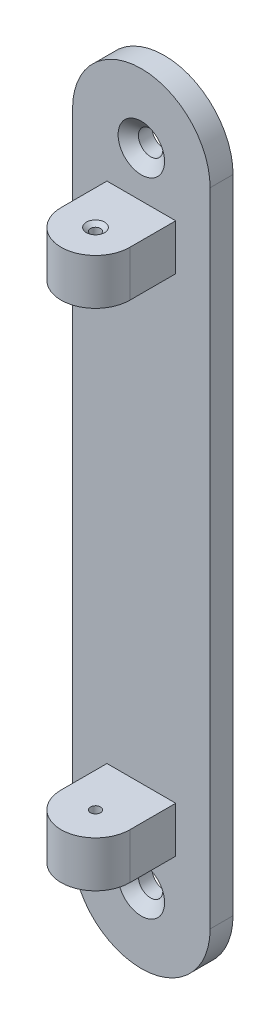
ISO-10303-21;
HEADER;
FILE_DESCRIPTION(('STEP AP214'),'2;1');
FILE_NAME('part.step','',(''),(''),'','','');
FILE_SCHEMA(('AUTOMOTIVE_DESIGN { 1 0 10303 214 1 1 1 1 }'));
ENDSEC;
DATA;
#1=APPLICATION_CONTEXT('core data for automotive mechanical design processes');
#2=APPLICATION_PROTOCOL_DEFINITION('international standard','automotive_design',2000,#1);
#3=PRODUCT_CONTEXT('',#1,'mechanical');
#4=PRODUCT('Part','Part','',(#3));
#5=PRODUCT_RELATED_PRODUCT_CATEGORY('part','',(#4));
#6=PRODUCT_DEFINITION_FORMATION('','',#4);
#7=PRODUCT_DEFINITION_CONTEXT('part definition',#1,'design');
#8=PRODUCT_DEFINITION('design','',#6,#7);
#9=PRODUCT_DEFINITION_SHAPE('','',#8);
#10=(LENGTH_UNIT() NAMED_UNIT(*) SI_UNIT(.MILLI.,.METRE.));
#11=(NAMED_UNIT(*) PLANE_ANGLE_UNIT() SI_UNIT($,.RADIAN.));
#12=(NAMED_UNIT(*) SI_UNIT($,.STERADIAN.) SOLID_ANGLE_UNIT());
#13=UNCERTAINTY_MEASURE_WITH_UNIT(LENGTH_MEASURE(1.E-05),#10,'distance_accuracy_value','');
#14=(GEOMETRIC_REPRESENTATION_CONTEXT(3) GLOBAL_UNCERTAINTY_ASSIGNED_CONTEXT((#13)) GLOBAL_UNIT_ASSIGNED_CONTEXT((#10,
#11,#12)) REPRESENTATION_CONTEXT('',''));
#15=CARTESIAN_POINT('',(0.,0.,0.));
#16=DIRECTION('',(0.,0.,1.));
#17=DIRECTION('',(1.,0.,0.));
#18=AXIS2_PLACEMENT_3D('',#15,#16,#17);
#19=CARTESIAN_POINT('',(19.05,88.9,6.35));
#20=DIRECTION('',(0.,0.,-1.));
#21=DIRECTION('',(-1.,0.,0.));
#22=AXIS2_PLACEMENT_3D('',#19,#20,#21);
#23=PLANE('',#22);
#24=DIRECTION('',(0.,-1.,0.));
#25=VECTOR('',#24,1.);
#26=CARTESIAN_POINT('',(0.,0.,6.35));
#27=LINE('',#26,#25);
#28=CARTESIAN_POINT('',(0.,88.9,6.35));
#29=VERTEX_POINT('',#28);
#30=CARTESIAN_POINT('',(0.,-88.9,6.35));
#31=VERTEX_POINT('',#30);
#32=EDGE_CURVE('E272',#29,#31,#27,.T.);
#33=ORIENTED_EDGE('',*,*,#32,.T.);
#34=CARTESIAN_POINT('',(19.05,-88.9,6.35));
#35=DIRECTION('',(0.,0.,-1.));
#36=DIRECTION('',(-1.,0.,0.));
#37=AXIS2_PLACEMENT_3D('',#34,#35,#36);
#38=CIRCLE('',#37,19.05);
#39=CARTESIAN_POINT('',(38.1,-88.9,6.35));
#40=VERTEX_POINT('',#39);
#41=EDGE_CURVE('E184',#40,#31,#38,.T.);
#42=ORIENTED_EDGE('',*,*,#41,.F.);
#43=DIRECTION('',(0.,1.,0.));
#44=VECTOR('',#43,1.);
#45=CARTESIAN_POINT('',(38.1,88.9,6.35));
#46=LINE('',#45,#44);
#47=CARTESIAN_POINT('',(38.1,88.9,6.35));
#48=VERTEX_POINT('',#47);
#49=EDGE_CURVE('E265',#40,#48,#46,.T.);
#50=ORIENTED_EDGE('',*,*,#49,.T.);
#51=CARTESIAN_POINT('',(19.05,88.9,6.35));
#52=DIRECTION('',(0.,0.,1.));
#53=DIRECTION('',(-1.,0.,0.));
#54=AXIS2_PLACEMENT_3D('',#51,#52,#53);
#55=CIRCLE('',#54,19.05);
#56=EDGE_CURVE('E268',#48,#29,#55,.T.);
#57=ORIENTED_EDGE('',*,*,#56,.T.);
#58=EDGE_LOOP('',(#33,#42,#50,#57));
#59=FACE_BOUND('',#58,.T.);
#60=CARTESIAN_POINT('',(19.05,88.9,6.35));
#61=DIRECTION('',(0.,0.,1.));
#62=DIRECTION('',(1.,0.,0.));
#63=AXIS2_PLACEMENT_3D('',#60,#61,#62);
#64=CIRCLE('',#63,6.4389);
#65=CARTESIAN_POINT('',(25.4889,88.9,6.35));
#66=VERTEX_POINT('',#65);
#67=EDGE_CURVE('E252',#66,#66,#64,.T.);
#68=ORIENTED_EDGE('',*,*,#67,.F.);
#69=EDGE_LOOP('',(#68));
#70=FACE_BOUND('',#69,.T.);
#71=DIRECTION('',(1.,0.,0.));
#72=VECTOR('',#71,1.);
#73=CARTESIAN_POINT('',(9.52500000000001,63.5071007439494,6.35));
#74=LINE('',#73,#72);
#75=CARTESIAN_POINT('',(9.52500000000001,63.5071007439494,6.35));
#76=VERTEX_POINT('',#75);
#77=CARTESIAN_POINT('',(28.575,63.5071007439494,6.35));
#78=VERTEX_POINT('',#77);
#79=EDGE_CURVE('E215',#76,#78,#74,.T.);
#80=ORIENTED_EDGE('',*,*,#79,.F.);
#81=DIRECTION('',(0.,-1.,0.));
#82=VECTOR('',#81,1.);
#83=CARTESIAN_POINT('',(9.525,76.2071007439494,6.35));
#84=LINE('',#83,#82);
#85=CARTESIAN_POINT('',(9.525,76.2071007439494,6.35));
#86=VERTEX_POINT('',#85);
#87=EDGE_CURVE('E224',#86,#76,#84,.T.);
#88=ORIENTED_EDGE('',*,*,#87,.F.);
#89=DIRECTION('',(1.,0.,0.));
#90=VECTOR('',#89,1.);
#91=CARTESIAN_POINT('',(9.525,76.2071007439494,6.35));
#92=LINE('',#91,#90);
#93=CARTESIAN_POINT('',(28.575,76.2071007439494,6.35));
#94=VERTEX_POINT('',#93);
#95=EDGE_CURVE('E64',#86,#94,#92,.T.);
#96=ORIENTED_EDGE('',*,*,#95,.T.);
#97=DIRECTION('',(0.,-1.,0.));
#98=VECTOR('',#97,1.);
#99=CARTESIAN_POINT('',(28.575,76.2071007439494,6.35));
#100=LINE('',#99,#98);
#101=EDGE_CURVE('E59',#94,#78,#100,.T.);
#102=ORIENTED_EDGE('',*,*,#101,.T.);
#103=EDGE_LOOP('',(#80,#88,#96,#102));
#104=FACE_BOUND('',#103,.T.);
#105=CARTESIAN_POINT('',(19.05,-88.9,6.35));
#106=DIRECTION('',(0.,0.,-1.));
#107=DIRECTION('',(1.,0.,0.));
#108=AXIS2_PLACEMENT_3D('',#105,#106,#107);
#109=CIRCLE('',#108,6.4389);
#110=CARTESIAN_POINT('',(25.4889,-88.9,6.35));
#111=VERTEX_POINT('',#110);
#112=EDGE_CURVE('E171',#111,#111,#109,.T.);
#113=ORIENTED_EDGE('',*,*,#112,.T.);
#114=EDGE_LOOP('',(#113));
#115=FACE_BOUND('',#114,.T.);
#116=DIRECTION('',(1.,0.,0.));
#117=VECTOR('',#116,1.);
#118=CARTESIAN_POINT('',(9.525,-63.5071007439494,6.35));
#119=LINE('',#118,#117);
#120=CARTESIAN_POINT('',(9.525,-63.5071007439494,6.35));
#121=VERTEX_POINT('',#120);
#122=CARTESIAN_POINT('',(28.575,-63.5071007439494,6.35));
#123=VERTEX_POINT('',#122);
#124=EDGE_CURVE('E151',#121,#123,#119,.T.);
#125=ORIENTED_EDGE('',*,*,#124,.T.);
#126=DIRECTION('',(0.,1.,0.));
#127=VECTOR('',#126,1.);
#128=CARTESIAN_POINT('',(28.575,-76.2071007439494,6.35));
#129=LINE('',#128,#127);
#130=CARTESIAN_POINT('',(28.575,-76.2071007439494,6.35));
#131=VERTEX_POINT('',#130);
#132=EDGE_CURVE('E345',#131,#123,#129,.T.);
#133=ORIENTED_EDGE('',*,*,#132,.F.);
#134=DIRECTION('',(1.,0.,0.));
#135=VECTOR('',#134,1.);
#136=CARTESIAN_POINT('',(9.525,-76.2071007439494,6.35));
#137=LINE('',#136,#135);
#138=CARTESIAN_POINT('',(9.525,-76.2071007439494,6.35));
#139=VERTEX_POINT('',#138);
#140=EDGE_CURVE('E349',#139,#131,#137,.T.);
#141=ORIENTED_EDGE('',*,*,#140,.F.);
#142=DIRECTION('',(0.,1.,0.));
#143=VECTOR('',#142,1.);
#144=CARTESIAN_POINT('',(9.525,-76.2071007439494,6.35));
#145=LINE('',#144,#143);
#146=EDGE_CURVE('E163',#139,#121,#145,.T.);
#147=ORIENTED_EDGE('',*,*,#146,.T.);
#148=EDGE_LOOP('',(#125,#133,#141,#147));
#149=FACE_BOUND('',#148,.T.);
#150=ADVANCED_FACE('F42',(#59,#70,#104,#115,#149),#23,.F.);
#151=CARTESIAN_POINT('',(38.1,88.9,6.35));
#152=DIRECTION('',(-1.,0.,0.));
#153=DIRECTION('',(0.,-1.,0.));
#154=AXIS2_PLACEMENT_3D('',#151,#152,#153);
#155=PLANE('',#154);
#156=DIRECTION('',(0.,1.,0.));
#157=VECTOR('',#156,1.);
#158=CARTESIAN_POINT('',(38.1,88.9,0.));
#159=LINE('',#158,#157);
#160=CARTESIAN_POINT('',(38.1,-88.9,0.));
#161=VERTEX_POINT('',#160);
#162=CARTESIAN_POINT('',(38.1,88.9,0.));
#163=VERTEX_POINT('',#162);
#164=EDGE_CURVE('E264',#161,#163,#159,.T.);
#165=ORIENTED_EDGE('',*,*,#164,.T.);
#166=DIRECTION('',(0.,0.,-1.));
#167=VECTOR('',#166,1.);
#168=CARTESIAN_POINT('',(38.1,88.9,6.35));
#169=LINE('',#168,#167);
#170=EDGE_CURVE('E11',#48,#163,#169,.T.);
#171=ORIENTED_EDGE('',*,*,#170,.F.);
#172=ORIENTED_EDGE('',*,*,#49,.F.);
#173=DIRECTION('',(0.,0.,-1.));
#174=VECTOR('',#173,1.);
#175=CARTESIAN_POINT('',(38.1,-88.9,6.35));
#176=LINE('',#175,#174);
#177=EDGE_CURVE('E195',#40,#161,#176,.T.);
#178=ORIENTED_EDGE('',*,*,#177,.T.);
#179=EDGE_LOOP('',(#165,#171,#172,#178));
#180=FACE_BOUND('',#179,.T.);
#181=ADVANCED_FACE('F44',(#180),#155,.F.);
#182=CARTESIAN_POINT('',(19.05,88.9,6.35));
#183=DIRECTION('',(0.,0.,-1.));
#184=DIRECTION('',(-1.,0.,0.));
#185=AXIS2_PLACEMENT_3D('',#182,#183,#184);
#186=CYLINDRICAL_SURFACE('',#185,19.05);
#187=CARTESIAN_POINT('',(19.05,88.9,0.));
#188=DIRECTION('',(0.,0.,1.));
#189=DIRECTION('',(-1.,0.,0.));
#190=AXIS2_PLACEMENT_3D('',#187,#188,#189);
#191=CIRCLE('',#190,19.05);
#192=CARTESIAN_POINT('',(0.,88.9,0.));
#193=VERTEX_POINT('',#192);
#194=EDGE_CURVE('E277',#163,#193,#191,.T.);
#195=ORIENTED_EDGE('',*,*,#194,.T.);
#196=DIRECTION('',(0.,0.,-1.));
#197=VECTOR('',#196,1.);
#198=CARTESIAN_POINT('',(0.,88.9,6.35));
#199=LINE('',#198,#197);
#200=EDGE_CURVE('E52',#29,#193,#199,.T.);
#201=ORIENTED_EDGE('',*,*,#200,.F.);
#202=ORIENTED_EDGE('',*,*,#56,.F.);
#203=ORIENTED_EDGE('',*,*,#170,.T.);
#204=EDGE_LOOP('',(#195,#201,#202,#203));
#205=FACE_BOUND('',#204,.T.);
#206=ADVANCED_FACE('F305',(#205),#186,.T.);
#207=CARTESIAN_POINT('',(0.,0.,6.35));
#208=DIRECTION('',(1.,0.,0.));
#209=DIRECTION('',(0.,0.,-1.));
#210=AXIS2_PLACEMENT_3D('',#207,#208,#209);
#211=PLANE('',#210);
#212=DIRECTION('',(0.,-1.,0.));
#213=VECTOR('',#212,1.);
#214=CARTESIAN_POINT('',(0.,0.,0.));
#215=LINE('',#214,#213);
#216=CARTESIAN_POINT('',(0.,-88.9,0.));
#217=VERTEX_POINT('',#216);
#218=EDGE_CURVE('E269',#193,#217,#215,.T.);
#219=ORIENTED_EDGE('',*,*,#218,.T.);
#220=DIRECTION('',(0.,0.,-1.));
#221=VECTOR('',#220,1.);
#222=CARTESIAN_POINT('',(0.,-88.9,6.35));
#223=LINE('',#222,#221);
#224=EDGE_CURVE('E188',#31,#217,#223,.T.);
#225=ORIENTED_EDGE('',*,*,#224,.F.);
#226=ORIENTED_EDGE('',*,*,#32,.F.);
#227=ORIENTED_EDGE('',*,*,#200,.T.);
#228=EDGE_LOOP('',(#219,#225,#226,#227));
#229=FACE_BOUND('',#228,.T.);
#230=ADVANCED_FACE('F288',(#229),#211,.F.);
#231=CARTESIAN_POINT('',(19.05,88.9,0.));
#232=DIRECTION('',(0.,0.,-1.));
#233=DIRECTION('',(-1.,0.,0.));
#234=AXIS2_PLACEMENT_3D('',#231,#232,#233);
#235=PLANE('',#234);
#236=CARTESIAN_POINT('',(19.05,88.9,0.));
#237=DIRECTION('',(0.,0.,1.));
#238=DIRECTION('',(1.,0.,0.));
#239=AXIS2_PLACEMENT_3D('',#236,#237,#238);
#240=CIRCLE('',#239,3.3782);
#241=CARTESIAN_POINT('',(22.4282,88.9,0.));
#242=VERTEX_POINT('',#241);
#243=EDGE_CURVE('E260',#242,#242,#240,.T.);
#244=ORIENTED_EDGE('',*,*,#243,.T.);
#245=EDGE_LOOP('',(#244));
#246=FACE_BOUND('',#245,.T.);
#247=ORIENTED_EDGE('',*,*,#164,.F.);
#248=CARTESIAN_POINT('',(19.05,-88.9,0.));
#249=DIRECTION('',(0.,0.,-1.));
#250=DIRECTION('',(-1.,0.,0.));
#251=AXIS2_PLACEMENT_3D('',#248,#249,#250);
#252=CIRCLE('',#251,19.05);
#253=EDGE_CURVE('E183',#161,#217,#252,.T.);
#254=ORIENTED_EDGE('',*,*,#253,.T.);
#255=ORIENTED_EDGE('',*,*,#218,.F.);
#256=ORIENTED_EDGE('',*,*,#194,.F.);
#257=EDGE_LOOP('',(#247,#254,#255,#256));
#258=FACE_BOUND('',#257,.T.);
#259=CARTESIAN_POINT('',(19.05,-88.9,0.));
#260=DIRECTION('',(0.,0.,-1.));
#261=DIRECTION('',(1.,0.,0.));
#262=AXIS2_PLACEMENT_3D('',#259,#260,#261);
#263=CIRCLE('',#262,3.3782);
#264=CARTESIAN_POINT('',(22.4282,-88.9,0.));
#265=VERTEX_POINT('',#264);
#266=EDGE_CURVE('E179',#265,#265,#263,.T.);
#267=ORIENTED_EDGE('',*,*,#266,.F.);
#268=EDGE_LOOP('',(#267));
#269=FACE_BOUND('',#268,.T.);
#270=ADVANCED_FACE('F294',(#246,#258,#269),#235,.T.);
#271=CARTESIAN_POINT('',(19.05,88.9,6.35));
#272=DIRECTION('',(0.,0.,1.));
#273=DIRECTION('',(1.,0.,0.));
#274=AXIS2_PLACEMENT_3D('',#271,#272,#273);
#275=CYLINDRICAL_SURFACE('',#274,3.37819999999999);
#276=ORIENTED_EDGE('',*,*,#243,.F.);
#277=EDGE_LOOP('',(#276));
#278=FACE_BOUND('',#277,.T.);
#279=CARTESIAN_POINT('',(19.05,88.9,3.78176775885568));
#280=DIRECTION('',(0.,0.,1.));
#281=DIRECTION('',(1.,0.,0.));
#282=AXIS2_PLACEMENT_3D('',#279,#280,#281);
#283=CIRCLE('',#282,3.37819999999999);
#284=CARTESIAN_POINT('',(22.4282,88.9,3.78176775885568));
#285=VERTEX_POINT('',#284);
#286=EDGE_CURVE('E256',#285,#285,#283,.T.);
#287=ORIENTED_EDGE('',*,*,#286,.T.);
#288=EDGE_LOOP('',(#287));
#289=FACE_BOUND('',#288,.T.);
#290=ADVANCED_FACE('F321',(#278,#289),#275,.F.);
#291=CARTESIAN_POINT('',(19.05,88.9,6.35));
#292=DIRECTION('',(0.,0.,1.));
#293=DIRECTION('',(1.,0.,0.));
#294=AXIS2_PLACEMENT_3D('',#291,#292,#293);
#295=CONICAL_SURFACE('',#294,6.4389,0.872664625997164);
#296=ORIENTED_EDGE('',*,*,#286,.F.);
#297=EDGE_LOOP('',(#296));
#298=FACE_BOUND('',#297,.T.);
#299=ORIENTED_EDGE('',*,*,#67,.T.);
#300=EDGE_LOOP('',(#299));
#301=FACE_BOUND('',#300,.T.);
#302=ADVANCED_FACE('F329',(#298,#301),#295,.F.);
#303=CARTESIAN_POINT('',(9.52500000000001,63.5071007439494,19.05));
#304=DIRECTION('',(0.,1.,0.));
#305=DIRECTION('',(0.,0.,1.));
#306=AXIS2_PLACEMENT_3D('',#303,#304,#305);
#307=PLANE('',#306);
#308=CARTESIAN_POINT('',(19.05,63.5071007439494,19.05));
#309=DIRECTION('',(0.,1.,0.));
#310=DIRECTION('',(0.,0.,1.));
#311=AXIS2_PLACEMENT_3D('',#308,#309,#310);
#312=CIRCLE('',#311,1.397);
#313=CARTESIAN_POINT('',(19.05,63.5071007439494,20.447));
#314=VERTEX_POINT('',#313);
#315=EDGE_CURVE('E46',#314,#314,#312,.T.);
#316=ORIENTED_EDGE('',*,*,#315,.T.);
#317=EDGE_LOOP('',(#316));
#318=FACE_BOUND('',#317,.T.);
#319=ORIENTED_EDGE('',*,*,#79,.T.);
#320=DIRECTION('',(0.,0.,-1.));
#321=VECTOR('',#320,1.);
#322=CARTESIAN_POINT('',(28.575,63.5071007439494,19.05));
#323=LINE('',#322,#321);
#324=CARTESIAN_POINT('',(28.575,63.5071007439494,19.05));
#325=VERTEX_POINT('',#324);
#326=EDGE_CURVE('E249',#325,#78,#323,.T.);
#327=ORIENTED_EDGE('',*,*,#326,.F.);
#328=CARTESIAN_POINT('',(19.05,63.5071007439494,19.05));
#329=DIRECTION('',(0.,-1.,0.));
#330=DIRECTION('',(0.,0.,-1.));
#331=AXIS2_PLACEMENT_3D('',#328,#329,#330);
#332=CIRCLE('',#331,9.525);
#333=CARTESIAN_POINT('',(9.525,63.5071007439494,19.05));
#334=VERTEX_POINT('',#333);
#335=EDGE_CURVE('E212',#325,#334,#332,.T.);
#336=ORIENTED_EDGE('',*,*,#335,.T.);
#337=DIRECTION('',(0.,0.,-1.));
#338=VECTOR('',#337,1.);
#339=CARTESIAN_POINT('',(9.52500000000001,63.5071007439494,19.05));
#340=LINE('',#339,#338);
#341=EDGE_CURVE('E228',#334,#76,#340,.T.);
#342=ORIENTED_EDGE('',*,*,#341,.T.);
#343=EDGE_LOOP('',(#319,#327,#336,#342));
#344=FACE_BOUND('',#343,.T.);
#345=ADVANCED_FACE('F337',(#318,#344),#307,.F.);
#346=CARTESIAN_POINT('',(28.575,76.2071007439494,19.05));
#347=DIRECTION('',(1.,0.,0.));
#348=DIRECTION('',(0.,0.,-1.));
#349=AXIS2_PLACEMENT_3D('',#346,#347,#348);
#350=PLANE('',#349);
#351=ORIENTED_EDGE('',*,*,#101,.F.);
#352=DIRECTION('',(0.,0.,-1.));
#353=VECTOR('',#352,1.);
#354=CARTESIAN_POINT('',(28.575,76.2071007439494,19.05));
#355=LINE('',#354,#353);
#356=CARTESIAN_POINT('',(28.575,76.2071007439494,19.05));
#357=VERTEX_POINT('',#356);
#358=EDGE_CURVE('E246',#357,#94,#355,.T.);
#359=ORIENTED_EDGE('',*,*,#358,.F.);
#360=DIRECTION('',(0.,-1.,0.));
#361=VECTOR('',#360,1.);
#362=CARTESIAN_POINT('',(28.575,76.2071007439494,19.05));
#363=LINE('',#362,#361);
#364=EDGE_CURVE('E219',#357,#325,#363,.T.);
#365=ORIENTED_EDGE('',*,*,#364,.T.);
#366=ORIENTED_EDGE('',*,*,#326,.T.);
#367=EDGE_LOOP('',(#351,#359,#365,#366));
#368=FACE_BOUND('',#367,.T.);
#369=ADVANCED_FACE('F423',(#368),#350,.T.);
#370=CARTESIAN_POINT('',(9.525,76.2071007439494,19.05));
#371=DIRECTION('',(0.,1.,0.));
#372=DIRECTION('',(0.,0.,1.));
#373=AXIS2_PLACEMENT_3D('',#370,#371,#372);
#374=PLANE('',#373);
#375=CARTESIAN_POINT('',(19.05,76.2071007439494,19.05));
#376=DIRECTION('',(0.,1.,0.));
#377=DIRECTION('',(0.,0.,1.));
#378=AXIS2_PLACEMENT_3D('',#375,#376,#377);
#379=CIRCLE('',#378,2.5273);
#380=CARTESIAN_POINT('',(19.05,76.2071007439494,21.5773));
#381=VERTEX_POINT('',#380);
#382=EDGE_CURVE('E199',#381,#381,#379,.T.);
#383=ORIENTED_EDGE('',*,*,#382,.F.);
#384=EDGE_LOOP('',(#383));
#385=FACE_BOUND('',#384,.T.);
#386=ORIENTED_EDGE('',*,*,#95,.F.);
#387=DIRECTION('',(0.,0.,-1.));
#388=VECTOR('',#387,1.);
#389=CARTESIAN_POINT('',(9.525,76.2071007439494,19.05));
#390=LINE('',#389,#388);
#391=CARTESIAN_POINT('',(9.525,76.2071007439494,19.05));
#392=VERTEX_POINT('',#391);
#393=EDGE_CURVE('E242',#392,#86,#390,.T.);
#394=ORIENTED_EDGE('',*,*,#393,.F.);
#395=CARTESIAN_POINT('',(19.05,76.2071007439494,19.05));
#396=DIRECTION('',(0.,-1.,0.));
#397=DIRECTION('',(0.,0.,-1.));
#398=AXIS2_PLACEMENT_3D('',#395,#396,#397);
#399=CIRCLE('',#398,9.525);
#400=EDGE_CURVE('E216',#357,#392,#399,.T.);
#401=ORIENTED_EDGE('',*,*,#400,.F.);
#402=ORIENTED_EDGE('',*,*,#358,.T.);
#403=EDGE_LOOP('',(#386,#394,#401,#402));
#404=FACE_BOUND('',#403,.T.);
#405=ADVANCED_FACE('F419',(#385,#404),#374,.T.);
#406=CARTESIAN_POINT('',(9.525,76.2071007439494,19.05));
#407=DIRECTION('',(1.,0.,0.));
#408=DIRECTION('',(0.,1.,0.));
#409=AXIS2_PLACEMENT_3D('',#406,#407,#408);
#410=PLANE('',#409);
#411=ORIENTED_EDGE('',*,*,#87,.T.);
#412=ORIENTED_EDGE('',*,*,#341,.F.);
#413=DIRECTION('',(0.,-1.,0.));
#414=VECTOR('',#413,1.);
#415=CARTESIAN_POINT('',(9.525,76.2071007439494,19.05));
#416=LINE('',#415,#414);
#417=EDGE_CURVE('E223',#392,#334,#416,.T.);
#418=ORIENTED_EDGE('',*,*,#417,.F.);
#419=ORIENTED_EDGE('',*,*,#393,.T.);
#420=EDGE_LOOP('',(#411,#412,#418,#419));
#421=FACE_BOUND('',#420,.T.);
#422=ADVANCED_FACE('F415',(#421),#410,.F.);
#423=CARTESIAN_POINT('',(19.05,63.5071007439494,19.05));
#424=DIRECTION('',(0.,1.,0.));
#425=DIRECTION('',(0.,0.,1.));
#426=AXIS2_PLACEMENT_3D('',#423,#424,#425);
#427=CYLINDRICAL_SURFACE('',#426,9.525);
#428=ORIENTED_EDGE('',*,*,#400,.T.);
#429=ORIENTED_EDGE('',*,*,#417,.T.);
#430=ORIENTED_EDGE('',*,*,#335,.F.);
#431=ORIENTED_EDGE('',*,*,#364,.F.);
#432=EDGE_LOOP('',(#428,#429,#430,#431));
#433=FACE_BOUND('',#432,.T.);
#434=ADVANCED_FACE('F411',(#433),#427,.T.);
#435=CARTESIAN_POINT('',(19.05,76.2071007439494,19.05));
#436=DIRECTION('',(0.,1.,0.));
#437=DIRECTION('',(0.,0.,1.));
#438=AXIS2_PLACEMENT_3D('',#435,#436,#437);
#439=CYLINDRICAL_SURFACE('',#438,1.397);
#440=CARTESIAN_POINT('',(19.05,75.2586664308297,19.05));
#441=DIRECTION('',(0.,1.,0.));
#442=DIRECTION('',(0.,0.,1.));
#443=AXIS2_PLACEMENT_3D('',#440,#441,#442);
#444=CIRCLE('',#443,1.397);
#445=CARTESIAN_POINT('',(19.05,75.2586664308297,20.447));
#446=VERTEX_POINT('',#445);
#447=EDGE_CURVE('E208',#446,#446,#444,.T.);
#448=ORIENTED_EDGE('',*,*,#447,.T.);
#449=EDGE_LOOP('',(#448));
#450=FACE_BOUND('',#449,.T.);
#451=ORIENTED_EDGE('',*,*,#315,.F.);
#452=EDGE_LOOP('',(#451));
#453=FACE_BOUND('',#452,.T.);
#454=ADVANCED_FACE('F407',(#450,#453),#439,.F.);
#455=CARTESIAN_POINT('',(19.05,76.2071007439494,19.05));
#456=DIRECTION('',(0.,1.,0.));
#457=DIRECTION('',(0.,0.,1.));
#458=AXIS2_PLACEMENT_3D('',#455,#456,#457);
#459=CONICAL_SURFACE('',#458,2.5273,0.872664625997164);
#460=ORIENTED_EDGE('',*,*,#447,.F.);
#461=EDGE_LOOP('',(#460));
#462=FACE_BOUND('',#461,.T.);
#463=ORIENTED_EDGE('',*,*,#382,.T.);
#464=EDGE_LOOP('',(#463));
#465=FACE_BOUND('',#464,.T.);
#466=ADVANCED_FACE('F404',(#462,#465),#459,.F.);
#467=CARTESIAN_POINT('',(19.05,-88.9,6.35));
#468=DIRECTION('',(0.,0.,-1.));
#469=DIRECTION('',(-1.,0.,0.));
#470=AXIS2_PLACEMENT_3D('',#467,#468,#469);
#471=CYLINDRICAL_SURFACE('',#470,19.05);
#472=ORIENTED_EDGE('',*,*,#253,.F.);
#473=ORIENTED_EDGE('',*,*,#177,.F.);
#474=ORIENTED_EDGE('',*,*,#41,.T.);
#475=ORIENTED_EDGE('',*,*,#224,.T.);
#476=EDGE_LOOP('',(#472,#473,#474,#475));
#477=FACE_BOUND('',#476,.T.);
#478=ADVANCED_FACE('F299',(#477),#471,.T.);
#479=CARTESIAN_POINT('',(19.05,-88.9,6.35));
#480=DIRECTION('',(0.,0.,1.));
#481=DIRECTION('',(1.,0.,0.));
#482=AXIS2_PLACEMENT_3D('',#479,#480,#481);
#483=CYLINDRICAL_SURFACE('',#482,3.37819999999999);
#484=ORIENTED_EDGE('',*,*,#266,.T.);
#485=EDGE_LOOP('',(#484));
#486=FACE_BOUND('',#485,.T.);
#487=CARTESIAN_POINT('',(19.05,-88.9,3.78176775885568));
#488=DIRECTION('',(0.,0.,-1.));
#489=DIRECTION('',(1.,0.,0.));
#490=AXIS2_PLACEMENT_3D('',#487,#488,#489);
#491=CIRCLE('',#490,3.37819999999999);
#492=CARTESIAN_POINT('',(22.4282,-88.9,3.78176775885568));
#493=VERTEX_POINT('',#492);
#494=EDGE_CURVE('E175',#493,#493,#491,.T.);
#495=ORIENTED_EDGE('',*,*,#494,.F.);
#496=EDGE_LOOP('',(#495));
#497=FACE_BOUND('',#496,.T.);
#498=ADVANCED_FACE('F398',(#486,#497),#483,.F.);
#499=CARTESIAN_POINT('',(19.05,-88.9,6.35));
#500=DIRECTION('',(0.,0.,1.));
#501=DIRECTION('',(1.,0.,0.));
#502=AXIS2_PLACEMENT_3D('',#499,#500,#501);
#503=CONICAL_SURFACE('',#502,6.4389,0.872664625997164);
#504=ORIENTED_EDGE('',*,*,#494,.T.);
#505=EDGE_LOOP('',(#504));
#506=FACE_BOUND('',#505,.T.);
#507=ORIENTED_EDGE('',*,*,#112,.F.);
#508=EDGE_LOOP('',(#507));
#509=FACE_BOUND('',#508,.T.);
#510=ADVANCED_FACE('F394',(#506,#509),#503,.F.);
#511=CARTESIAN_POINT('',(9.525,-63.5071007439494,19.05));
#512=DIRECTION('',(0.,-1.,0.));
#513=DIRECTION('',(0.,0.,1.));
#514=AXIS2_PLACEMENT_3D('',#511,#512,#513);
#515=PLANE('',#514);
#516=CARTESIAN_POINT('',(19.05,-63.5071007439494,19.05));
#517=DIRECTION('',(0.,1.,0.));
#518=DIRECTION('',(0.,0.,1.));
#519=AXIS2_PLACEMENT_3D('',#516,#517,#518);
#520=CIRCLE('',#519,1.397);
#521=CARTESIAN_POINT('',(19.05,-63.5071007439494,20.447));
#522=VERTEX_POINT('',#521);
#523=EDGE_CURVE('E200',#522,#522,#520,.T.);
#524=ORIENTED_EDGE('',*,*,#523,.F.);
#525=EDGE_LOOP('',(#524));
#526=FACE_BOUND('',#525,.T.);
#527=ORIENTED_EDGE('',*,*,#124,.F.);
#528=DIRECTION('',(0.,0.,-1.));
#529=VECTOR('',#528,1.);
#530=CARTESIAN_POINT('',(9.525,-63.5071007439494,19.05));
#531=LINE('',#530,#529);
#532=CARTESIAN_POINT('',(9.525,-63.5071007439494,19.05));
#533=VERTEX_POINT('',#532);
#534=EDGE_CURVE('E136',#533,#121,#531,.T.);
#535=ORIENTED_EDGE('',*,*,#534,.F.);
#536=CARTESIAN_POINT('',(19.05,-63.5071007439494,19.05));
#537=DIRECTION('',(0.,-1.,0.));
#538=DIRECTION('',(0.,0.,-1.));
#539=AXIS2_PLACEMENT_3D('',#536,#537,#538);
#540=CIRCLE('',#539,9.525);
#541=CARTESIAN_POINT('',(28.575,-63.5071007439494,19.05));
#542=VERTEX_POINT('',#541);
#543=EDGE_CURVE('E145',#542,#533,#540,.T.);
#544=ORIENTED_EDGE('',*,*,#543,.F.);
#545=DIRECTION('',(0.,0.,-1.));
#546=VECTOR('',#545,1.);
#547=CARTESIAN_POINT('',(28.575,-63.5071007439494,19.05));
#548=LINE('',#547,#546);
#549=EDGE_CURVE('E168',#542,#123,#548,.T.);
#550=ORIENTED_EDGE('',*,*,#549,.T.);
#551=EDGE_LOOP('',(#527,#535,#544,#550));
#552=FACE_BOUND('',#551,.T.);
#553=ADVANCED_FACE('F155',(#526,#552),#515,.F.);
#554=CARTESIAN_POINT('',(28.575,-76.2071007439494,19.05));
#555=DIRECTION('',(1.,0.,0.));
#556=DIRECTION('',(0.,0.,-1.));
#557=AXIS2_PLACEMENT_3D('',#554,#555,#556);
#558=PLANE('',#557);
#559=ORIENTED_EDGE('',*,*,#132,.T.);
#560=ORIENTED_EDGE('',*,*,#549,.F.);
#561=DIRECTION('',(0.,1.,0.));
#562=VECTOR('',#561,1.);
#563=CARTESIAN_POINT('',(28.575,-76.2071007439494,19.05));
#564=LINE('',#563,#562);
#565=CARTESIAN_POINT('',(28.575,-76.2071007439494,19.05));
#566=VERTEX_POINT('',#565);
#567=EDGE_CURVE('E142',#566,#542,#564,.T.);
#568=ORIENTED_EDGE('',*,*,#567,.F.);
#569=DIRECTION('',(0.,0.,-1.));
#570=VECTOR('',#569,1.);
#571=CARTESIAN_POINT('',(28.575,-76.2071007439494,19.05));
#572=LINE('',#571,#570);
#573=EDGE_CURVE('E160',#566,#131,#572,.T.);
#574=ORIENTED_EDGE('',*,*,#573,.T.);
#575=EDGE_LOOP('',(#559,#560,#568,#574));
#576=FACE_BOUND('',#575,.T.);
#577=ADVANCED_FACE('F388',(#576),#558,.T.);
#578=CARTESIAN_POINT('',(9.525,-76.2071007439494,19.05));
#579=DIRECTION('',(0.,-1.,0.));
#580=DIRECTION('',(0.,0.,1.));
#581=AXIS2_PLACEMENT_3D('',#578,#579,#580);
#582=PLANE('',#581);
#583=CARTESIAN_POINT('',(19.05,-76.2071007439494,19.05));
#584=DIRECTION('',(0.,1.,0.));
#585=DIRECTION('',(0.,0.,1.));
#586=AXIS2_PLACEMENT_3D('',#583,#584,#585);
#587=CIRCLE('',#586,2.5273);
#588=CARTESIAN_POINT('',(19.05,-76.2071007439494,21.5773));
#589=VERTEX_POINT('',#588);
#590=EDGE_CURVE('E364',#589,#589,#587,.T.);
#591=ORIENTED_EDGE('',*,*,#590,.T.);
#592=EDGE_LOOP('',(#591));
#593=FACE_BOUND('',#592,.T.);
#594=ORIENTED_EDGE('',*,*,#140,.T.);
#595=ORIENTED_EDGE('',*,*,#573,.F.);
#596=CARTESIAN_POINT('',(19.05,-76.2071007439494,19.05));
#597=DIRECTION('',(0.,-1.,0.));
#598=DIRECTION('',(0.,0.,-1.));
#599=AXIS2_PLACEMENT_3D('',#596,#597,#598);
#600=CIRCLE('',#599,9.525);
#601=CARTESIAN_POINT('',(9.525,-76.2071007439494,19.05));
#602=VERTEX_POINT('',#601);
#603=EDGE_CURVE('E152',#566,#602,#600,.T.);
#604=ORIENTED_EDGE('',*,*,#603,.T.);
#605=DIRECTION('',(0.,0.,-1.));
#606=VECTOR('',#605,1.);
#607=CARTESIAN_POINT('',(9.525,-76.2071007439494,19.05));
#608=LINE('',#607,#606);
#609=EDGE_CURVE('E138',#602,#139,#608,.T.);
#610=ORIENTED_EDGE('',*,*,#609,.T.);
#611=EDGE_LOOP('',(#594,#595,#604,#610));
#612=FACE_BOUND('',#611,.T.);
#613=ADVANCED_FACE('F369',(#593,#612),#582,.T.);
#614=CARTESIAN_POINT('',(9.525,-76.2071007439494,19.05));
#615=DIRECTION('',(1.,0.,0.));
#616=DIRECTION('',(0.,-1.,0.));
#617=AXIS2_PLACEMENT_3D('',#614,#615,#616);
#618=PLANE('',#617);
#619=ORIENTED_EDGE('',*,*,#146,.F.);
#620=ORIENTED_EDGE('',*,*,#609,.F.);
#621=DIRECTION('',(0.,1.,0.));
#622=VECTOR('',#621,1.);
#623=CARTESIAN_POINT('',(9.525,-76.2071007439494,19.05));
#624=LINE('',#623,#622);
#625=EDGE_CURVE('E131',#602,#533,#624,.T.);
#626=ORIENTED_EDGE('',*,*,#625,.T.);
#627=ORIENTED_EDGE('',*,*,#534,.T.);
#628=EDGE_LOOP('',(#619,#620,#626,#627));
#629=FACE_BOUND('',#628,.T.);
#630=ADVANCED_FACE('F134',(#629),#618,.F.);
#631=CARTESIAN_POINT('',(19.05,-63.5071007439494,19.05));
#632=DIRECTION('',(0.,-1.,0.));
#633=DIRECTION('',(0.,0.,1.));
#634=AXIS2_PLACEMENT_3D('',#631,#632,#633);
#635=CYLINDRICAL_SURFACE('',#634,9.525);
#636=ORIENTED_EDGE('',*,*,#603,.F.);
#637=ORIENTED_EDGE('',*,*,#567,.T.);
#638=ORIENTED_EDGE('',*,*,#543,.T.);
#639=ORIENTED_EDGE('',*,*,#625,.F.);
#640=EDGE_LOOP('',(#636,#637,#638,#639));
#641=FACE_BOUND('',#640,.T.);
#642=ADVANCED_FACE('F146',(#641),#635,.T.);
#643=CARTESIAN_POINT('',(19.05,-76.2071007439494,19.05));
#644=DIRECTION('',(0.,-1.,0.));
#645=DIRECTION('',(0.,0.,1.));
#646=AXIS2_PLACEMENT_3D('',#643,#644,#645);
#647=CYLINDRICAL_SURFACE('',#646,1.397);
#648=CARTESIAN_POINT('',(19.05,-75.2586664308297,19.05));
#649=DIRECTION('',(0.,1.,0.));
#650=DIRECTION('',(0.,0.,1.));
#651=AXIS2_PLACEMENT_3D('',#648,#649,#650);
#652=CIRCLE('',#651,1.397);
#653=CARTESIAN_POINT('',(19.05,-75.2586664308297,20.447));
#654=VERTEX_POINT('',#653);
#655=EDGE_CURVE('E204',#654,#654,#652,.T.);
#656=ORIENTED_EDGE('',*,*,#655,.F.);
#657=EDGE_LOOP('',(#656));
#658=FACE_BOUND('',#657,.T.);
#659=ORIENTED_EDGE('',*,*,#523,.T.);
#660=EDGE_LOOP('',(#659));
#661=FACE_BOUND('',#660,.T.);
#662=ADVANCED_FACE('F373',(#658,#661),#647,.F.);
#663=CARTESIAN_POINT('',(19.05,-76.2071007439494,19.05));
#664=DIRECTION('',(0.,-1.,0.));
#665=DIRECTION('',(0.,0.,1.));
#666=AXIS2_PLACEMENT_3D('',#663,#664,#665);
#667=CONICAL_SURFACE('',#666,2.5273,0.872664625997164);
#668=ORIENTED_EDGE('',*,*,#655,.T.);
#669=EDGE_LOOP('',(#668));
#670=FACE_BOUND('',#669,.T.);
#671=ORIENTED_EDGE('',*,*,#590,.F.);
#672=EDGE_LOOP('',(#671));
#673=FACE_BOUND('',#672,.T.);
#674=ADVANCED_FACE('F371',(#670,#673),#667,.F.);
#675=CLOSED_SHELL('',(#150,#181,#206,#230,#270,#290,#302,#345,#369,#405,#422,#434,#454,#466,
#478,#498,#510,#553,#577,#613,#630,#642,#662,#674));
#676=MANIFOLD_SOLID_BREP('B2',#675);
#677=ADVANCED_BREP_SHAPE_REPRESENTATION('',(#18,#676),#14);
#678=SHAPE_DEFINITION_REPRESENTATION(#9,#677);
ENDSEC;
END-ISO-10303-21;
